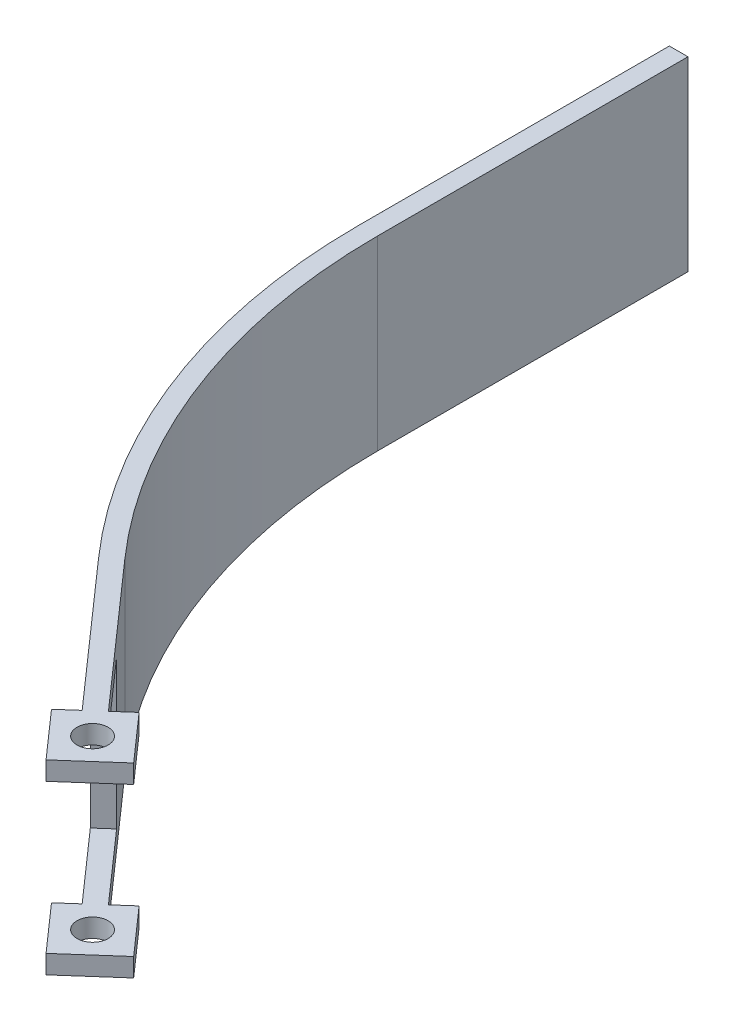
ISO-10303-21;
HEADER;
FILE_DESCRIPTION(('STEP AP214'),'2;1');
FILE_NAME('part.step','',(''),(''),'','','');
FILE_SCHEMA(('AUTOMOTIVE_DESIGN { 1 0 10303 214 1 1 1 1 }'));
ENDSEC;
DATA;
#1=APPLICATION_CONTEXT('core data for automotive mechanical design processes');
#2=APPLICATION_PROTOCOL_DEFINITION('international standard','automotive_design',2000,#1);
#3=PRODUCT_CONTEXT('',#1,'mechanical');
#4=PRODUCT('Part','Part','',(#3));
#5=PRODUCT_RELATED_PRODUCT_CATEGORY('part','',(#4));
#6=PRODUCT_DEFINITION_FORMATION('','',#4);
#7=PRODUCT_DEFINITION_CONTEXT('part definition',#1,'design');
#8=PRODUCT_DEFINITION('design','',#6,#7);
#9=PRODUCT_DEFINITION_SHAPE('','',#8);
#10=(LENGTH_UNIT() NAMED_UNIT(*) SI_UNIT(.MILLI.,.METRE.));
#11=(NAMED_UNIT(*) PLANE_ANGLE_UNIT() SI_UNIT($,.RADIAN.));
#12=(NAMED_UNIT(*) SI_UNIT($,.STERADIAN.) SOLID_ANGLE_UNIT());
#13=UNCERTAINTY_MEASURE_WITH_UNIT(LENGTH_MEASURE(1.E-05),#10,'distance_accuracy_value','');
#14=(GEOMETRIC_REPRESENTATION_CONTEXT(3) GLOBAL_UNCERTAINTY_ASSIGNED_CONTEXT((#13)) GLOBAL_UNIT_ASSIGNED_CONTEXT((#10,
#11,#12)) REPRESENTATION_CONTEXT('',''));
#15=CARTESIAN_POINT('',(0.,0.,0.));
#16=DIRECTION('',(0.,0.,1.));
#17=DIRECTION('',(1.,0.,0.));
#18=AXIS2_PLACEMENT_3D('',#15,#16,#17);
#19=CARTESIAN_POINT('',(42.7724766555669,30.,92.3165774846784));
#20=DIRECTION('',(0.661879281336678,0.,0.749610443455294));
#21=DIRECTION('',(0.749610443455294,0.,-0.661879281336678));
#22=AXIS2_PLACEMENT_3D('',#19,#20,#21);
#23=PLANE('',#22);
#24=DIRECTION('',(0.,-1.,0.));
#25=VECTOR('',#24,1.);
#26=CARTESIAN_POINT('',(42.7724766555669,30.,92.3165774846784));
#27=LINE('',#26,#25);
#28=CARTESIAN_POINT('',(42.7724766555669,3.,92.3165774846784));
#29=VERTEX_POINT('',#28);
#30=CARTESIAN_POINT('',(42.7724766555669,0.,92.3165774846784));
#31=VERTEX_POINT('',#30);
#32=EDGE_CURVE('E218',#29,#31,#27,.T.);
#33=ORIENTED_EDGE('',*,*,#32,.F.);
#34=DIRECTION('',(0.749610443455294,0.,-0.661879281336678));
#35=VECTOR('',#34,1.);
#36=CARTESIAN_POINT('',(42.7724766555669,3.,92.3165774846784));
#37=LINE('',#36,#35);
#38=CARTESIAN_POINT('',(45.3961132076604,3.,90.));
#39=VERTEX_POINT('',#38);
#40=EDGE_CURVE('E255',#29,#39,#37,.T.);
#41=ORIENTED_EDGE('',*,*,#40,.T.);
#42=DIRECTION('',(0.,-1.,0.));
#43=VECTOR('',#42,1.);
#44=CARTESIAN_POINT('',(45.3961132076604,30.,90.));
#45=LINE('',#44,#43);
#46=CARTESIAN_POINT('',(45.3961132076604,0.,90.));
#47=VERTEX_POINT('',#46);
#48=EDGE_CURVE('E222',#39,#47,#45,.T.);
#49=ORIENTED_EDGE('',*,*,#48,.T.);
#50=DIRECTION('',(-0.749610443455294,0.,0.661879281336678));
#51=VECTOR('',#50,1.);
#52=CARTESIAN_POINT('',(42.7724766555669,0.,92.3165774846784));
#53=LINE('',#52,#51);
#54=EDGE_CURVE('E172',#47,#31,#53,.T.);
#55=ORIENTED_EDGE('',*,*,#54,.T.);
#56=EDGE_LOOP('',(#33,#41,#49,#55));
#57=FACE_BOUND('',#56,.T.);
#58=ADVANCED_FACE('F31',(#57),#23,.F.);
#59=CARTESIAN_POINT('',(49.3912694689336,30.,99.8126819192313));
#60=DIRECTION('',(0.749610443455293,0.,-0.661879281336679));
#61=DIRECTION('',(-0.661879281336679,0.,-0.749610443455293));
#62=AXIS2_PLACEMENT_3D('',#59,#60,#61);
#63=PLANE('',#62);
#64=DIRECTION('',(0.,-1.,0.));
#65=VECTOR('',#64,1.);
#66=CARTESIAN_POINT('',(49.3912694689336,30.,99.8126819192313));
#67=LINE('',#66,#65);
#68=CARTESIAN_POINT('',(49.3912694689337,3.,99.8126819192313));
#69=VERTEX_POINT('',#68);
#70=CARTESIAN_POINT('',(49.3912694689336,0.,99.8126819192313));
#71=VERTEX_POINT('',#70);
#72=EDGE_CURVE('E214',#69,#71,#67,.T.);
#73=ORIENTED_EDGE('',*,*,#72,.F.);
#74=DIRECTION('',(0.661879281336679,0.,0.749610443455293));
#75=VECTOR('',#74,1.);
#76=CARTESIAN_POINT('',(49.3912694689337,3.,99.8126819192313));
#77=LINE('',#76,#75);
#78=EDGE_CURVE('E375',#29,#69,#77,.T.);
#79=ORIENTED_EDGE('',*,*,#78,.F.);
#80=ORIENTED_EDGE('',*,*,#32,.T.);
#81=DIRECTION('',(0.661879281336679,0.,0.749610443455293));
#82=VECTOR('',#81,1.);
#83=CARTESIAN_POINT('',(49.3912694689336,0.,99.8126819192313));
#84=LINE('',#83,#82);
#85=EDGE_CURVE('E175',#31,#71,#84,.T.);
#86=ORIENTED_EDGE('',*,*,#85,.T.);
#87=EDGE_LOOP('',(#73,#79,#80,#86));
#88=FACE_BOUND('',#87,.T.);
#89=ADVANCED_FACE('F373',(#88),#63,.F.);
#90=CARTESIAN_POINT('',(56.8873739034866,30.,93.1938891058645));
#91=DIRECTION('',(-0.661879281336678,0.,-0.749610443455294));
#92=DIRECTION('',(-0.749610443455294,0.,0.661879281336678));
#93=AXIS2_PLACEMENT_3D('',#90,#91,#92);
#94=PLANE('',#93);
#95=DIRECTION('',(0.,-1.,0.));
#96=VECTOR('',#95,1.);
#97=CARTESIAN_POINT('',(56.8873739034866,30.,93.1938891058645));
#98=LINE('',#97,#96);
#99=CARTESIAN_POINT('',(56.8873739034866,3.,93.1938891058645));
#100=VERTEX_POINT('',#99);
#101=CARTESIAN_POINT('',(56.8873739034866,0.,93.1938891058645));
#102=VERTEX_POINT('',#101);
#103=EDGE_CURVE('E210',#100,#102,#98,.T.);
#104=ORIENTED_EDGE('',*,*,#103,.F.);
#105=DIRECTION('',(-0.749610443455293,0.,0.661879281336679));
#106=VECTOR('',#105,1.);
#107=CARTESIAN_POINT('',(127.933254186093,3.,30.4629111773426));
#108=LINE('',#107,#106);
#109=EDGE_CURVE('E230',#100,#69,#108,.T.);
#110=ORIENTED_EDGE('',*,*,#109,.T.);
#111=ORIENTED_EDGE('',*,*,#72,.T.);
#112=DIRECTION('',(0.749610443455294,0.,-0.661879281336678));
#113=VECTOR('',#112,1.);
#114=CARTESIAN_POINT('',(56.8873739034866,0.,93.1938891058645));
#115=LINE('',#114,#113);
#116=EDGE_CURVE('E178',#71,#102,#115,.T.);
#117=ORIENTED_EDGE('',*,*,#116,.T.);
#118=EDGE_LOOP('',(#104,#110,#111,#117));
#119=FACE_BOUND('',#118,.T.);
#120=ADVANCED_FACE('F398',(#119),#94,.F.);
#121=CARTESIAN_POINT('',(50.2685810901198,30.,85.6977846713116));
#122=DIRECTION('',(-0.749610443455293,0.,0.661879281336679));
#123=DIRECTION('',(0.661879281336679,0.,0.749610443455293));
#124=AXIS2_PLACEMENT_3D('',#121,#122,#123);
#125=PLANE('',#124);
#126=DIRECTION('',(0.,-1.,0.));
#127=VECTOR('',#126,1.);
#128=CARTESIAN_POINT('',(50.2685810901198,30.,85.6977846713116));
#129=LINE('',#128,#127);
#130=CARTESIAN_POINT('',(50.2685810901198,3.,85.6977846713116));
#131=VERTEX_POINT('',#130);
#132=CARTESIAN_POINT('',(50.2685810901198,0.,85.6977846713116));
#133=VERTEX_POINT('',#132);
#134=EDGE_CURVE('E206',#131,#133,#129,.T.);
#135=ORIENTED_EDGE('',*,*,#134,.F.);
#136=DIRECTION('',(0.661879281336679,0.,0.749610443455293));
#137=VECTOR('',#136,1.);
#138=CARTESIAN_POINT('',(50.2685810901198,3.,85.6977846713116));
#139=LINE('',#138,#137);
#140=EDGE_CURVE('E252',#131,#100,#139,.T.);
#141=ORIENTED_EDGE('',*,*,#140,.T.);
#142=ORIENTED_EDGE('',*,*,#103,.T.);
#143=DIRECTION('',(-0.661879281336679,0.,-0.749610443455293));
#144=VECTOR('',#143,1.);
#145=CARTESIAN_POINT('',(50.2685810901198,0.,85.6977846713116));
#146=LINE('',#145,#144);
#147=EDGE_CURVE('E181',#102,#133,#146,.T.);
#148=ORIENTED_EDGE('',*,*,#147,.T.);
#149=EDGE_LOOP('',(#135,#141,#142,#148));
#150=FACE_BOUND('',#149,.T.);
#151=ADVANCED_FACE('F395',(#150),#125,.F.);
#152=CARTESIAN_POINT('',(47.6449445380263,30.,88.01436215599));
#153=DIRECTION('',(0.661879281336685,0.,0.749610443455288));
#154=DIRECTION('',(0.749610443455288,0.,-0.661879281336685));
#155=AXIS2_PLACEMENT_3D('',#152,#153,#154);
#156=PLANE('',#155);
#157=DIRECTION('',(0.,-1.,0.));
#158=VECTOR('',#157,1.);
#159=CARTESIAN_POINT('',(47.6449445380263,30.,88.01436215599));
#160=LINE('',#159,#158);
#161=CARTESIAN_POINT('',(47.6449445380263,3.,88.01436215599));
#162=VERTEX_POINT('',#161);
#163=CARTESIAN_POINT('',(47.6449445380263,0.,88.01436215599));
#164=VERTEX_POINT('',#163);
#165=EDGE_CURVE('E202',#162,#164,#160,.T.);
#166=ORIENTED_EDGE('',*,*,#165,.F.);
#167=DIRECTION('',(0.749610443455288,0.,-0.661879281336685));
#168=VECTOR('',#167,1.);
#169=CARTESIAN_POINT('',(47.6449445380263,3.,88.01436215599));
#170=LINE('',#169,#168);
#171=EDGE_CURVE('E238',#162,#131,#170,.T.);
#172=ORIENTED_EDGE('',*,*,#171,.T.);
#173=ORIENTED_EDGE('',*,*,#134,.T.);
#174=DIRECTION('',(-0.749610443455288,0.,0.661879281336685));
#175=VECTOR('',#174,1.);
#176=CARTESIAN_POINT('',(47.6449445380263,0.,88.01436215599));
#177=LINE('',#176,#175);
#178=EDGE_CURVE('E184',#133,#164,#177,.T.);
#179=ORIENTED_EDGE('',*,*,#178,.T.);
#180=EDGE_LOOP('',(#166,#172,#173,#179));
#181=FACE_BOUND('',#180,.T.);
#182=ADVANCED_FACE('F391',(#181),#156,.F.);
#183=CARTESIAN_POINT('',(49.8299252795267,30.,92.7552332952715));
#184=DIRECTION('',(0.,-1.,0.));
#185=DIRECTION('',(0.,0.,-1.));
#186=AXIS2_PLACEMENT_3D('',#183,#184,#185);
#187=CYLINDRICAL_SURFACE('',#186,2.5);
#188=CARTESIAN_POINT('',(49.8299252795267,3.,92.7552332952715));
#189=DIRECTION('',(0.,-1.,0.));
#190=DIRECTION('',(0.,0.,-1.));
#191=AXIS2_PLACEMENT_3D('',#188,#189,#190);
#192=CIRCLE('',#191,2.5);
#193=CARTESIAN_POINT('',(49.8299252795267,3.,90.2552332952715));
#194=VERTEX_POINT('',#193);
#195=EDGE_CURVE('E231',#194,#194,#192,.T.);
#196=ORIENTED_EDGE('',*,*,#195,.F.);
#197=EDGE_LOOP('',(#196));
#198=FACE_BOUND('',#197,.T.);
#199=CARTESIAN_POINT('',(49.8299252795267,0.,92.7552332952715));
#200=DIRECTION('',(0.,1.,0.));
#201=DIRECTION('',(0.,0.,1.));
#202=AXIS2_PLACEMENT_3D('',#199,#200,#201);
#203=CIRCLE('',#202,2.5);
#204=CARTESIAN_POINT('',(49.8299252795267,0.,95.2552332952715));
#205=VERTEX_POINT('',#204);
#206=EDGE_CURVE('E263',#205,#205,#203,.T.);
#207=ORIENTED_EDGE('',*,*,#206,.F.);
#208=EDGE_LOOP('',(#207));
#209=FACE_BOUND('',#208,.T.);
#210=ADVANCED_FACE('F434',(#198,#209),#187,.F.);
#211=CARTESIAN_POINT('',(102.,30.,0.));
#212=DIRECTION('',(0.,1.,0.));
#213=DIRECTION('',(0.,0.,1.));
#214=AXIS2_PLACEMENT_3D('',#211,#212,#213);
#215=PLANE('',#214);
#216=CARTESIAN_POINT('',(102.,30.,0.));
#217=DIRECTION('',(0.,1.,0.));
#218=DIRECTION('',(0.,0.,1.));
#219=AXIS2_PLACEMENT_3D('',#216,#217,#218);
#220=CIRCLE('',#219,102.);
#221=CARTESIAN_POINT('',(0.,30.,0.));
#222=VERTEX_POINT('',#221);
#223=CARTESIAN_POINT('',(25.53973476756,30.,67.5116866963412));
#224=VERTEX_POINT('',#223);
#225=EDGE_CURVE('E195',#222,#224,#220,.T.);
#226=ORIENTED_EDGE('',*,*,#225,.T.);
#227=DIRECTION('',(0.661879281336679,0.,0.749610443455293));
#228=VECTOR('',#227,1.);
#229=CARTESIAN_POINT('',(25.53973476756,30.,67.5116866963412));
#230=LINE('',#229,#228);
#231=CARTESIAN_POINT('',(45.3961132076604,30.,90.));
#232=VERTEX_POINT('',#231);
#233=EDGE_CURVE('E109',#224,#232,#230,.T.);
#234=ORIENTED_EDGE('',*,*,#233,.T.);
#235=DIRECTION('',(-0.749610443455294,0.,0.661879281336678));
#236=VECTOR('',#235,1.);
#237=CARTESIAN_POINT('',(42.7724766555669,30.,92.3165774846784));
#238=LINE('',#237,#236);
#239=CARTESIAN_POINT('',(42.7724766555669,30.,92.3165774846784));
#240=VERTEX_POINT('',#239);
#241=EDGE_CURVE('E270',#232,#240,#238,.T.);
#242=ORIENTED_EDGE('',*,*,#241,.T.);
#243=DIRECTION('',(0.661879281336679,0.,0.749610443455293));
#244=VECTOR('',#243,1.);
#245=CARTESIAN_POINT('',(49.3912694689336,30.,99.8126819192313));
#246=LINE('',#245,#244);
#247=CARTESIAN_POINT('',(49.3912694689336,30.,99.8126819192313));
#248=VERTEX_POINT('',#247);
#249=EDGE_CURVE('E272',#240,#248,#246,.T.);
#250=ORIENTED_EDGE('',*,*,#249,.T.);
#251=DIRECTION('',(0.749610443455294,0.,-0.661879281336678));
#252=VECTOR('',#251,1.);
#253=CARTESIAN_POINT('',(56.8873739034866,30.,93.1938891058645));
#254=LINE('',#253,#252);
#255=CARTESIAN_POINT('',(56.8873739034866,30.,93.1938891058645));
#256=VERTEX_POINT('',#255);
#257=EDGE_CURVE('E274',#248,#256,#254,.T.);
#258=ORIENTED_EDGE('',*,*,#257,.T.);
#259=DIRECTION('',(-0.661879281336679,0.,-0.749610443455293));
#260=VECTOR('',#259,1.);
#261=CARTESIAN_POINT('',(50.2685810901198,30.,85.6977846713116));
#262=LINE('',#261,#260);
#263=CARTESIAN_POINT('',(50.2685810901198,30.,85.6977846713116));
#264=VERTEX_POINT('',#263);
#265=EDGE_CURVE('E276',#256,#264,#262,.T.);
#266=ORIENTED_EDGE('',*,*,#265,.T.);
#267=DIRECTION('',(-0.749610443455288,0.,0.661879281336685));
#268=VECTOR('',#267,1.);
#269=CARTESIAN_POINT('',(47.6449445380263,30.,88.01436215599));
#270=LINE('',#269,#268);
#271=CARTESIAN_POINT('',(47.6449445380263,30.,88.01436215599));
#272=VERTEX_POINT('',#271);
#273=EDGE_CURVE('E278',#264,#272,#270,.T.);
#274=ORIENTED_EDGE('',*,*,#273,.T.);
#275=DIRECTION('',(-0.661879281336679,0.,-0.749610443455294));
#276=VECTOR('',#275,1.);
#277=CARTESIAN_POINT('',(27.7885660979259,30.,65.5260488523312));
#278=LINE('',#277,#276);
#279=CARTESIAN_POINT('',(27.7885660979259,30.,65.5260488523311));
#280=VERTEX_POINT('',#279);
#281=EDGE_CURVE('E280',#272,#280,#278,.T.);
#282=ORIENTED_EDGE('',*,*,#281,.T.);
#283=CARTESIAN_POINT('',(102.,30.,0.));
#284=DIRECTION('',(0.,-1.,0.));
#285=DIRECTION('',(0.,0.,1.));
#286=AXIS2_PLACEMENT_3D('',#283,#284,#285);
#287=CIRCLE('',#286,99.);
#288=CARTESIAN_POINT('',(3.00000000000001,30.,7.12266617214352E-13));
#289=VERTEX_POINT('',#288);
#290=EDGE_CURVE('E144',#280,#289,#287,.T.);
#291=ORIENTED_EDGE('',*,*,#290,.T.);
#292=DIRECTION('',(0.,0.,-1.));
#293=VECTOR('',#292,1.);
#294=CARTESIAN_POINT('',(3.,30.,-50.));
#295=LINE('',#294,#293);
#296=CARTESIAN_POINT('',(3.,30.,-50.));
#297=VERTEX_POINT('',#296);
#298=EDGE_CURVE('E136',#289,#297,#295,.T.);
#299=ORIENTED_EDGE('',*,*,#298,.T.);
#300=DIRECTION('',(-1.,0.,0.));
#301=VECTOR('',#300,1.);
#302=CARTESIAN_POINT('',(0.,30.,-50.));
#303=LINE('',#302,#301);
#304=CARTESIAN_POINT('',(0.,30.,-50.));
#305=VERTEX_POINT('',#304);
#306=EDGE_CURVE('E141',#297,#305,#303,.T.);
#307=ORIENTED_EDGE('',*,*,#306,.T.);
#308=DIRECTION('',(0.,0.,1.));
#309=VECTOR('',#308,1.);
#310=CARTESIAN_POINT('',(0.,30.,0.));
#311=LINE('',#310,#309);
#312=EDGE_CURVE('E55',#305,#222,#311,.T.);
#313=ORIENTED_EDGE('',*,*,#312,.T.);
#314=EDGE_LOOP('',(#226,#234,#242,#250,#258,#266,#274,#282,#291,#299,#307,#313));
#315=FACE_BOUND('',#314,.T.);
#316=CARTESIAN_POINT('',(49.8299252795267,30.,92.7552332952715));
#317=DIRECTION('',(0.,1.,0.));
#318=DIRECTION('',(0.,0.,1.));
#319=AXIS2_PLACEMENT_3D('',#316,#317,#318);
#320=CIRCLE('',#319,2.5);
#321=CARTESIAN_POINT('',(49.8299252795267,30.,95.2552332952715));
#322=VERTEX_POINT('',#321);
#323=EDGE_CURVE('E169',#322,#322,#320,.T.);
#324=ORIENTED_EDGE('',*,*,#323,.F.);
#325=EDGE_LOOP('',(#324));
#326=FACE_BOUND('',#325,.T.);
#327=ADVANCED_FACE('F138',(#315,#326),#215,.T.);
#328=CARTESIAN_POINT('',(102.,0.,0.));
#329=DIRECTION('',(0.,1.,0.));
#330=DIRECTION('',(0.,0.,1.));
#331=AXIS2_PLACEMENT_3D('',#328,#329,#330);
#332=PLANE('',#331);
#333=CARTESIAN_POINT('',(102.,0.,0.));
#334=DIRECTION('',(0.,1.,0.));
#335=DIRECTION('',(0.,0.,1.));
#336=AXIS2_PLACEMENT_3D('',#333,#334,#335);
#337=CIRCLE('',#336,102.);
#338=CARTESIAN_POINT('',(0.,0.,0.));
#339=VERTEX_POINT('',#338);
#340=CARTESIAN_POINT('',(25.53973476756,0.,67.5116866963412));
#341=VERTEX_POINT('',#340);
#342=EDGE_CURVE('E165',#339,#341,#337,.T.);
#343=ORIENTED_EDGE('',*,*,#342,.F.);
#344=DIRECTION('',(0.,0.,1.));
#345=VECTOR('',#344,1.);
#346=CARTESIAN_POINT('',(0.,0.,0.));
#347=LINE('',#346,#345);
#348=CARTESIAN_POINT('',(0.,0.,-50.));
#349=VERTEX_POINT('',#348);
#350=EDGE_CURVE('E100',#349,#339,#347,.T.);
#351=ORIENTED_EDGE('',*,*,#350,.F.);
#352=DIRECTION('',(-1.,0.,0.));
#353=VECTOR('',#352,1.);
#354=CARTESIAN_POINT('',(0.,0.,-50.));
#355=LINE('',#354,#353);
#356=CARTESIAN_POINT('',(3.,0.,-50.));
#357=VERTEX_POINT('',#356);
#358=EDGE_CURVE('E192',#357,#349,#355,.T.);
#359=ORIENTED_EDGE('',*,*,#358,.F.);
#360=DIRECTION('',(0.,0.,-1.));
#361=VECTOR('',#360,1.);
#362=CARTESIAN_POINT('',(3.,0.,-50.));
#363=LINE('',#362,#361);
#364=CARTESIAN_POINT('',(3.00000000000001,0.,7.12266617214352E-13));
#365=VERTEX_POINT('',#364);
#366=EDGE_CURVE('E153',#365,#357,#363,.T.);
#367=ORIENTED_EDGE('',*,*,#366,.F.);
#368=CARTESIAN_POINT('',(102.,0.,0.));
#369=DIRECTION('',(0.,-1.,0.));
#370=DIRECTION('',(0.,0.,1.));
#371=AXIS2_PLACEMENT_3D('',#368,#369,#370);
#372=CIRCLE('',#371,99.);
#373=CARTESIAN_POINT('',(27.7885660979259,0.,65.5260488523311));
#374=VERTEX_POINT('',#373);
#375=EDGE_CURVE('E189',#374,#365,#372,.T.);
#376=ORIENTED_EDGE('',*,*,#375,.F.);
#377=DIRECTION('',(-0.661879281336679,0.,-0.749610443455294));
#378=VECTOR('',#377,1.);
#379=CARTESIAN_POINT('',(27.7885660979259,0.,65.5260488523312));
#380=LINE('',#379,#378);
#381=EDGE_CURVE('E187',#164,#374,#380,.T.);
#382=ORIENTED_EDGE('',*,*,#381,.F.);
#383=ORIENTED_EDGE('',*,*,#178,.F.);
#384=ORIENTED_EDGE('',*,*,#147,.F.);
#385=ORIENTED_EDGE('',*,*,#116,.F.);
#386=ORIENTED_EDGE('',*,*,#85,.F.);
#387=ORIENTED_EDGE('',*,*,#54,.F.);
#388=DIRECTION('',(0.661879281336679,0.,0.749610443455293));
#389=VECTOR('',#388,1.);
#390=CARTESIAN_POINT('',(25.53973476756,0.,67.5116866963412));
#391=LINE('',#390,#389);
#392=EDGE_CURVE('E168',#341,#47,#391,.T.);
#393=ORIENTED_EDGE('',*,*,#392,.F.);
#394=EDGE_LOOP('',(#343,#351,#359,#367,#376,#382,#383,#384,#385,#386,#387,#393));
#395=FACE_BOUND('',#394,.T.);
#396=ORIENTED_EDGE('',*,*,#206,.T.);
#397=EDGE_LOOP('',(#396));
#398=FACE_BOUND('',#397,.T.);
#399=ADVANCED_FACE('F293',(#395,#398),#332,.F.);
#400=CARTESIAN_POINT('',(102.,30.,0.));
#401=DIRECTION('',(0.,-1.,0.));
#402=DIRECTION('',(0.,0.,-1.));
#403=AXIS2_PLACEMENT_3D('',#400,#401,#402);
#404=CYLINDRICAL_SURFACE('',#403,102.);
#405=ORIENTED_EDGE('',*,*,#342,.T.);
#406=DIRECTION('',(0.,-1.,0.));
#407=VECTOR('',#406,1.);
#408=CARTESIAN_POINT('',(25.53973476756,30.,67.5116866963412));
#409=LINE('',#408,#407);
#410=EDGE_CURVE('E39',#224,#341,#409,.T.);
#411=ORIENTED_EDGE('',*,*,#410,.F.);
#412=ORIENTED_EDGE('',*,*,#225,.F.);
#413=DIRECTION('',(0.,-1.,0.));
#414=VECTOR('',#413,1.);
#415=CARTESIAN_POINT('',(0.,30.,0.));
#416=LINE('',#415,#414);
#417=EDGE_CURVE('E161',#222,#339,#416,.T.);
#418=ORIENTED_EDGE('',*,*,#417,.T.);
#419=EDGE_LOOP('',(#405,#411,#412,#418));
#420=FACE_BOUND('',#419,.T.);
#421=ADVANCED_FACE('F33',(#420),#404,.T.);
#422=CARTESIAN_POINT('',(25.53973476756,30.,67.5116866963412));
#423=DIRECTION('',(0.749610443455293,0.,-0.661879281336679));
#424=DIRECTION('',(-0.661879281336679,0.,-0.749610443455293));
#425=AXIS2_PLACEMENT_3D('',#422,#423,#424);
#426=PLANE('',#425);
#427=ORIENTED_EDGE('',*,*,#48,.F.);
#428=DIRECTION('',(-0.661879281336679,0.,-0.749610443455293));
#429=VECTOR('',#428,1.);
#430=CARTESIAN_POINT('',(25.53973476756,3.,67.5116866963412));
#431=LINE('',#430,#429);
#432=CARTESIAN_POINT('',(35.4679239876102,3.,78.7558433481706));
#433=VERTEX_POINT('',#432);
#434=EDGE_CURVE('E258',#39,#433,#431,.T.);
#435=ORIENTED_EDGE('',*,*,#434,.T.);
#436=DIRECTION('',(0.,1.,0.));
#437=VECTOR('',#436,1.);
#438=CARTESIAN_POINT('',(35.4679239876102,30.,78.7558433481706));
#439=LINE('',#438,#437);
#440=CARTESIAN_POINT('',(35.4679239876102,27.,78.7558433481706));
#441=VERTEX_POINT('',#440);
#442=EDGE_CURVE('E261',#433,#441,#439,.T.);
#443=ORIENTED_EDGE('',*,*,#442,.T.);
#444=DIRECTION('',(0.661879281336679,0.,0.749610443455293));
#445=VECTOR('',#444,1.);
#446=CARTESIAN_POINT('',(25.53973476756,27.,67.5116866963412));
#447=LINE('',#446,#445);
#448=CARTESIAN_POINT('',(45.3961132076604,27.,90.));
#449=VERTEX_POINT('',#448);
#450=EDGE_CURVE('E234',#441,#449,#447,.T.);
#451=ORIENTED_EDGE('',*,*,#450,.T.);
#452=EDGE_CURVE('E223',#232,#449,#45,.T.);
#453=ORIENTED_EDGE('',*,*,#452,.F.);
#454=ORIENTED_EDGE('',*,*,#233,.F.);
#455=ORIENTED_EDGE('',*,*,#410,.T.);
#456=ORIENTED_EDGE('',*,*,#392,.T.);
#457=EDGE_LOOP('',(#427,#435,#443,#451,#453,#454,#455,#456));
#458=FACE_BOUND('',#457,.T.);
#459=ADVANCED_FACE('F302',(#458),#426,.F.);
#460=ORIENTED_EDGE('',*,*,#452,.T.);
#461=DIRECTION('',(-0.749610443455294,0.,0.661879281336678));
#462=VECTOR('',#461,1.);
#463=CARTESIAN_POINT('',(42.7724766555669,27.,92.3165774846784));
#464=LINE('',#463,#462);
#465=CARTESIAN_POINT('',(42.7724766555669,27.,92.3165774846784));
#466=VERTEX_POINT('',#465);
#467=EDGE_CURVE('E241',#449,#466,#464,.T.);
#468=ORIENTED_EDGE('',*,*,#467,.T.);
#469=EDGE_CURVE('E219',#240,#466,#27,.T.);
#470=ORIENTED_EDGE('',*,*,#469,.F.);
#471=ORIENTED_EDGE('',*,*,#241,.F.);
#472=EDGE_LOOP('',(#460,#468,#470,#471));
#473=FACE_BOUND('',#472,.T.);
#474=ADVANCED_FACE('F304',(#473),#23,.F.);
#475=ORIENTED_EDGE('',*,*,#469,.T.);
#476=DIRECTION('',(-0.661879281336679,0.,-0.749610443455293));
#477=VECTOR('',#476,1.);
#478=CARTESIAN_POINT('',(49.3912694689337,27.,99.8126819192313));
#479=LINE('',#478,#477);
#480=CARTESIAN_POINT('',(49.3912694689337,27.,99.8126819192313));
#481=VERTEX_POINT('',#480);
#482=EDGE_CURVE('E377',#481,#466,#479,.T.);
#483=ORIENTED_EDGE('',*,*,#482,.F.);
#484=EDGE_CURVE('E215',#248,#481,#67,.T.);
#485=ORIENTED_EDGE('',*,*,#484,.F.);
#486=ORIENTED_EDGE('',*,*,#249,.F.);
#487=EDGE_LOOP('',(#475,#483,#485,#486));
#488=FACE_BOUND('',#487,.T.);
#489=ADVANCED_FACE('F311',(#488),#63,.F.);
#490=ORIENTED_EDGE('',*,*,#484,.T.);
#491=DIRECTION('',(-0.749610443455293,0.,0.661879281336679));
#492=VECTOR('',#491,1.);
#493=CARTESIAN_POINT('',(127.933254186093,27.,30.4629111773426));
#494=LINE('',#493,#492);
#495=CARTESIAN_POINT('',(56.8873739034866,27.,93.1938891058645));
#496=VERTEX_POINT('',#495);
#497=EDGE_CURVE('E321',#496,#481,#494,.T.);
#498=ORIENTED_EDGE('',*,*,#497,.F.);
#499=EDGE_CURVE('E211',#256,#496,#98,.T.);
#500=ORIENTED_EDGE('',*,*,#499,.F.);
#501=ORIENTED_EDGE('',*,*,#257,.F.);
#502=EDGE_LOOP('',(#490,#498,#500,#501));
#503=FACE_BOUND('',#502,.T.);
#504=ADVANCED_FACE('F318',(#503),#94,.F.);
#505=ORIENTED_EDGE('',*,*,#499,.T.);
#506=DIRECTION('',(-0.661879281336679,0.,-0.749610443455293));
#507=VECTOR('',#506,1.);
#508=CARTESIAN_POINT('',(50.2685810901198,27.,85.6977846713116));
#509=LINE('',#508,#507);
#510=CARTESIAN_POINT('',(50.2685810901198,27.,85.6977846713116));
#511=VERTEX_POINT('',#510);
#512=EDGE_CURVE('E246',#496,#511,#509,.T.);
#513=ORIENTED_EDGE('',*,*,#512,.T.);
#514=EDGE_CURVE('E207',#264,#511,#129,.T.);
#515=ORIENTED_EDGE('',*,*,#514,.F.);
#516=ORIENTED_EDGE('',*,*,#265,.F.);
#517=EDGE_LOOP('',(#505,#513,#515,#516));
#518=FACE_BOUND('',#517,.T.);
#519=ADVANCED_FACE('F324',(#518),#125,.F.);
#520=ORIENTED_EDGE('',*,*,#514,.T.);
#521=DIRECTION('',(-0.749610443455288,0.,0.661879281336685));
#522=VECTOR('',#521,1.);
#523=CARTESIAN_POINT('',(47.6449445380263,27.,88.01436215599));
#524=LINE('',#523,#522);
#525=CARTESIAN_POINT('',(47.6449445380263,27.,88.01436215599));
#526=VERTEX_POINT('',#525);
#527=EDGE_CURVE('E332',#511,#526,#524,.T.);
#528=ORIENTED_EDGE('',*,*,#527,.T.);
#529=EDGE_CURVE('E203',#272,#526,#160,.T.);
#530=ORIENTED_EDGE('',*,*,#529,.F.);
#531=ORIENTED_EDGE('',*,*,#273,.F.);
#532=EDGE_LOOP('',(#520,#528,#530,#531));
#533=FACE_BOUND('',#532,.T.);
#534=ADVANCED_FACE('F329',(#533),#156,.F.);
#535=CARTESIAN_POINT('',(27.7885660979259,30.,65.5260488523312));
#536=DIRECTION('',(-0.749610443455294,0.,0.661879281336679));
#537=DIRECTION('',(0.661879281336679,0.,0.749610443455294));
#538=AXIS2_PLACEMENT_3D('',#535,#536,#537);
#539=PLANE('',#538);
#540=DIRECTION('',(0.,-1.,0.));
#541=VECTOR('',#540,1.);
#542=CARTESIAN_POINT('',(37.7167553179761,30.,76.7702055041606));
#543=LINE('',#542,#541);
#544=CARTESIAN_POINT('',(37.7167553179761,27.,76.7702055041606));
#545=VERTEX_POINT('',#544);
#546=CARTESIAN_POINT('',(37.7167553179761,3.,76.7702055041606));
#547=VERTEX_POINT('',#546);
#548=EDGE_CURVE('E11',#545,#547,#543,.T.);
#549=ORIENTED_EDGE('',*,*,#548,.T.);
#550=DIRECTION('',(0.661879281336679,0.,0.749610443455294));
#551=VECTOR('',#550,1.);
#552=CARTESIAN_POINT('',(27.7885660979259,3.,65.5260488523312));
#553=LINE('',#552,#551);
#554=EDGE_CURVE('E233',#547,#162,#553,.T.);
#555=ORIENTED_EDGE('',*,*,#554,.T.);
#556=ORIENTED_EDGE('',*,*,#165,.T.);
#557=ORIENTED_EDGE('',*,*,#381,.T.);
#558=DIRECTION('',(0.,-1.,0.));
#559=VECTOR('',#558,1.);
#560=CARTESIAN_POINT('',(27.7885660979259,30.,65.5260488523311));
#561=LINE('',#560,#559);
#562=EDGE_CURVE('E199',#280,#374,#561,.T.);
#563=ORIENTED_EDGE('',*,*,#562,.F.);
#564=ORIENTED_EDGE('',*,*,#281,.F.);
#565=ORIENTED_EDGE('',*,*,#529,.T.);
#566=DIRECTION('',(-0.661879281336679,0.,-0.749610443455294));
#567=VECTOR('',#566,1.);
#568=CARTESIAN_POINT('',(27.7885660979259,27.,65.5260488523312));
#569=LINE('',#568,#567);
#570=EDGE_CURVE('E229',#526,#545,#569,.T.);
#571=ORIENTED_EDGE('',*,*,#570,.T.);
#572=EDGE_LOOP('',(#549,#555,#556,#557,#563,#564,#565,#571));
#573=FACE_BOUND('',#572,.T.);
#574=ADVANCED_FACE('F286',(#573),#539,.F.);
#575=CARTESIAN_POINT('',(102.,30.,0.));
#576=DIRECTION('',(0.,-1.,0.));
#577=DIRECTION('',(0.,0.,-1.));
#578=AXIS2_PLACEMENT_3D('',#575,#576,#577);
#579=CYLINDRICAL_SURFACE('',#578,99.);
#580=ORIENTED_EDGE('',*,*,#375,.T.);
#581=DIRECTION('',(0.,-1.,0.));
#582=VECTOR('',#581,1.);
#583=CARTESIAN_POINT('',(3.00000000000001,30.,7.12266617214352E-13));
#584=LINE('',#583,#582);
#585=EDGE_CURVE('E156',#289,#365,#584,.T.);
#586=ORIENTED_EDGE('',*,*,#585,.F.);
#587=ORIENTED_EDGE('',*,*,#290,.F.);
#588=ORIENTED_EDGE('',*,*,#562,.T.);
#589=EDGE_LOOP('',(#580,#586,#587,#588));
#590=FACE_BOUND('',#589,.T.);
#591=ADVANCED_FACE('F290',(#590),#579,.F.);
#592=CARTESIAN_POINT('',(3.,30.,-50.));
#593=DIRECTION('',(-1.,0.,0.));
#594=DIRECTION('',(0.,0.,1.));
#595=AXIS2_PLACEMENT_3D('',#592,#593,#594);
#596=PLANE('',#595);
#597=ORIENTED_EDGE('',*,*,#366,.T.);
#598=DIRECTION('',(0.,-1.,0.));
#599=VECTOR('',#598,1.);
#600=CARTESIAN_POINT('',(3.,30.,-50.));
#601=LINE('',#600,#599);
#602=EDGE_CURVE('E150',#297,#357,#601,.T.);
#603=ORIENTED_EDGE('',*,*,#602,.F.);
#604=ORIENTED_EDGE('',*,*,#298,.F.);
#605=ORIENTED_EDGE('',*,*,#585,.T.);
#606=EDGE_LOOP('',(#597,#603,#604,#605));
#607=FACE_BOUND('',#606,.T.);
#608=ADVANCED_FACE('F151',(#607),#596,.F.);
#609=CARTESIAN_POINT('',(0.,30.,-50.));
#610=DIRECTION('',(0.,0.,1.));
#611=DIRECTION('',(1.,0.,0.));
#612=AXIS2_PLACEMENT_3D('',#609,#610,#611);
#613=PLANE('',#612);
#614=ORIENTED_EDGE('',*,*,#358,.T.);
#615=DIRECTION('',(0.,-1.,0.));
#616=VECTOR('',#615,1.);
#617=CARTESIAN_POINT('',(0.,30.,-50.));
#618=LINE('',#617,#616);
#619=EDGE_CURVE('E157',#305,#349,#618,.T.);
#620=ORIENTED_EDGE('',*,*,#619,.F.);
#621=ORIENTED_EDGE('',*,*,#306,.F.);
#622=ORIENTED_EDGE('',*,*,#602,.T.);
#623=EDGE_LOOP('',(#614,#620,#621,#622));
#624=FACE_BOUND('',#623,.T.);
#625=ADVANCED_FACE('F159',(#624),#613,.F.);
#626=CARTESIAN_POINT('',(0.,30.,0.));
#627=DIRECTION('',(1.,0.,0.));
#628=DIRECTION('',(0.,0.,-1.));
#629=AXIS2_PLACEMENT_3D('',#626,#627,#628);
#630=PLANE('',#629);
#631=ORIENTED_EDGE('',*,*,#350,.T.);
#632=ORIENTED_EDGE('',*,*,#417,.F.);
#633=ORIENTED_EDGE('',*,*,#312,.F.);
#634=ORIENTED_EDGE('',*,*,#619,.T.);
#635=EDGE_LOOP('',(#631,#632,#633,#634));
#636=FACE_BOUND('',#635,.T.);
#637=ADVANCED_FACE('F295',(#636),#630,.F.);
#638=CARTESIAN_POINT('',(49.8299252795267,27.,92.7552332952715));
#639=DIRECTION('',(0.,1.,0.));
#640=DIRECTION('',(0.,0.,1.));
#641=AXIS2_PLACEMENT_3D('',#638,#639,#640);
#642=CIRCLE('',#641,2.5);
#643=CARTESIAN_POINT('',(49.8299252795267,27.,95.2552332952715));
#644=VERTEX_POINT('',#643);
#645=EDGE_CURVE('E227',#644,#644,#642,.T.);
#646=ORIENTED_EDGE('',*,*,#645,.F.);
#647=EDGE_LOOP('',(#646));
#648=FACE_BOUND('',#647,.T.);
#649=ORIENTED_EDGE('',*,*,#323,.T.);
#650=EDGE_LOOP('',(#649));
#651=FACE_BOUND('',#650,.T.);
#652=ADVANCED_FACE('F439',(#648,#651),#187,.F.);
#653=CARTESIAN_POINT('',(111.386272152676,27.,11.7226500909603));
#654=DIRECTION('',(-0.661879281336679,0.,-0.749610443455293));
#655=DIRECTION('',(-0.749610443455293,0.,0.661879281336679));
#656=AXIS2_PLACEMENT_3D('',#653,#654,#655);
#657=PLANE('',#656);
#658=DIRECTION('',(-0.749610443455293,0.,0.661879281336679));
#659=VECTOR('',#658,1.);
#660=CARTESIAN_POINT('',(111.386272152676,3.,11.7226500909603));
#661=LINE('',#660,#659);
#662=EDGE_CURVE('E364',#547,#433,#661,.T.);
#663=ORIENTED_EDGE('',*,*,#662,.F.);
#664=ORIENTED_EDGE('',*,*,#548,.F.);
#665=DIRECTION('',(-0.749610443455293,0.,0.661879281336679));
#666=VECTOR('',#665,1.);
#667=CARTESIAN_POINT('',(111.386272152676,27.,11.7226500909603));
#668=LINE('',#667,#666);
#669=EDGE_CURVE('E46',#545,#441,#668,.T.);
#670=ORIENTED_EDGE('',*,*,#669,.T.);
#671=ORIENTED_EDGE('',*,*,#442,.F.);
#672=EDGE_LOOP('',(#663,#664,#670,#671));
#673=FACE_BOUND('',#672,.T.);
#674=ADVANCED_FACE('F388',(#673),#657,.F.);
#675=CARTESIAN_POINT('',(127.933254186093,3.,30.4629111773426));
#676=DIRECTION('',(0.,-1.,0.));
#677=DIRECTION('',(0.,0.,-1.));
#678=AXIS2_PLACEMENT_3D('',#675,#676,#677);
#679=PLANE('',#678);
#680=ORIENTED_EDGE('',*,*,#195,.T.);
#681=EDGE_LOOP('',(#680));
#682=FACE_BOUND('',#681,.T.);
#683=ORIENTED_EDGE('',*,*,#40,.F.);
#684=ORIENTED_EDGE('',*,*,#78,.T.);
#685=ORIENTED_EDGE('',*,*,#109,.F.);
#686=ORIENTED_EDGE('',*,*,#140,.F.);
#687=ORIENTED_EDGE('',*,*,#171,.F.);
#688=ORIENTED_EDGE('',*,*,#554,.F.);
#689=ORIENTED_EDGE('',*,*,#662,.T.);
#690=ORIENTED_EDGE('',*,*,#434,.F.);
#691=EDGE_LOOP('',(#683,#684,#685,#686,#687,#688,#689,#690));
#692=FACE_BOUND('',#691,.T.);
#693=ADVANCED_FACE('F360',(#682,#692),#679,.F.);
#694=CARTESIAN_POINT('',(127.933254186093,27.,30.4629111773426));
#695=DIRECTION('',(0.,1.,0.));
#696=DIRECTION('',(0.,0.,1.));
#697=AXIS2_PLACEMENT_3D('',#694,#695,#696);
#698=PLANE('',#697);
#699=ORIENTED_EDGE('',*,*,#645,.T.);
#700=EDGE_LOOP('',(#699));
#701=FACE_BOUND('',#700,.T.);
#702=ORIENTED_EDGE('',*,*,#669,.F.);
#703=ORIENTED_EDGE('',*,*,#570,.F.);
#704=ORIENTED_EDGE('',*,*,#527,.F.);
#705=ORIENTED_EDGE('',*,*,#512,.F.);
#706=ORIENTED_EDGE('',*,*,#497,.T.);
#707=ORIENTED_EDGE('',*,*,#482,.T.);
#708=ORIENTED_EDGE('',*,*,#467,.F.);
#709=ORIENTED_EDGE('',*,*,#450,.F.);
#710=EDGE_LOOP('',(#702,#703,#704,#705,#706,#707,#708,#709));
#711=FACE_BOUND('',#710,.T.);
#712=ADVANCED_FACE('F403',(#701,#711),#698,.F.);
#713=CLOSED_SHELL('',(#58,#89,#120,#151,#182,#210,#327,#399,#421,#459,#474,#489,#504,#519,#534,
#574,#591,#608,#625,#637,#652,#674,#693,#712));
#714=MANIFOLD_SOLID_BREP('B2',#713);
#715=ADVANCED_BREP_SHAPE_REPRESENTATION('',(#18,#714),#14);
#716=SHAPE_DEFINITION_REPRESENTATION(#9,#715);
ENDSEC;
END-ISO-10303-21;
